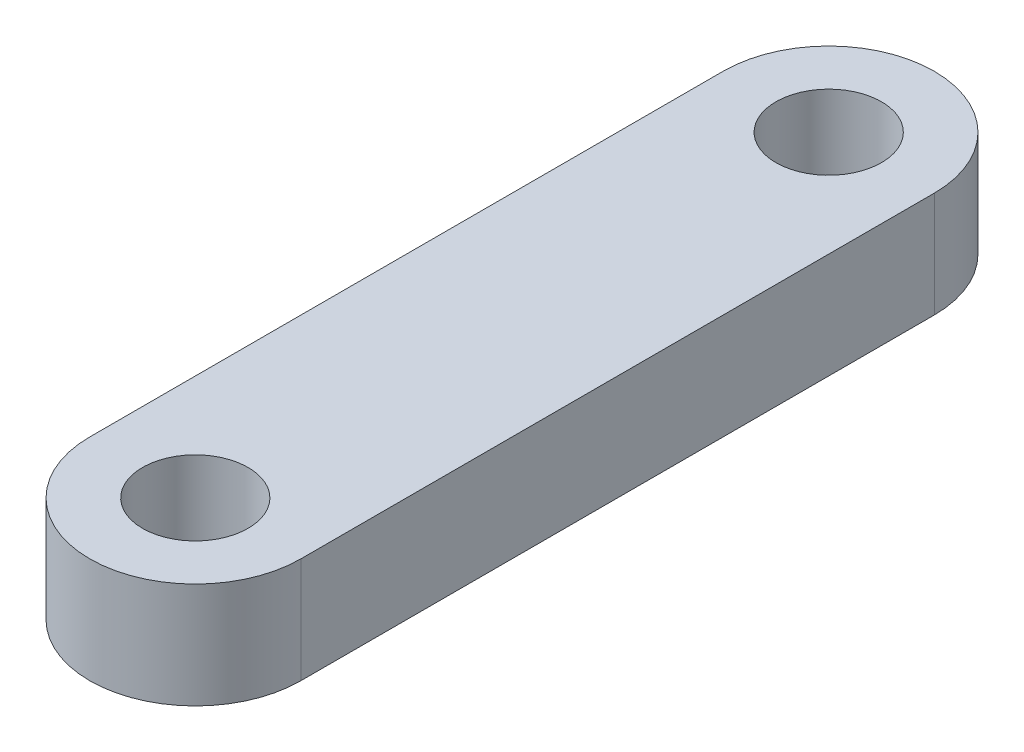
ISO-10303-21;
HEADER;
FILE_DESCRIPTION(('STEP AP214'),'2;1');
FILE_NAME('part.step','',(''),(''),'','','');
FILE_SCHEMA(('AUTOMOTIVE_DESIGN { 1 0 10303 214 1 1 1 1 }'));
ENDSEC;
DATA;
#1=APPLICATION_CONTEXT('core data for automotive mechanical design processes');
#2=APPLICATION_PROTOCOL_DEFINITION('international standard','automotive_design',2000,#1);
#3=PRODUCT_CONTEXT('',#1,'mechanical');
#4=PRODUCT('Part','Part','',(#3));
#5=PRODUCT_RELATED_PRODUCT_CATEGORY('part','',(#4));
#6=PRODUCT_DEFINITION_FORMATION('','',#4);
#7=PRODUCT_DEFINITION_CONTEXT('part definition',#1,'design');
#8=PRODUCT_DEFINITION('design','',#6,#7);
#9=PRODUCT_DEFINITION_SHAPE('','',#8);
#10=(LENGTH_UNIT() NAMED_UNIT(*) SI_UNIT(.MILLI.,.METRE.));
#11=(NAMED_UNIT(*) PLANE_ANGLE_UNIT() SI_UNIT($,.RADIAN.));
#12=(NAMED_UNIT(*) SI_UNIT($,.STERADIAN.) SOLID_ANGLE_UNIT());
#13=UNCERTAINTY_MEASURE_WITH_UNIT(LENGTH_MEASURE(1.E-05),#10,'distance_accuracy_value','');
#14=(GEOMETRIC_REPRESENTATION_CONTEXT(3) GLOBAL_UNCERTAINTY_ASSIGNED_CONTEXT((#13)) GLOBAL_UNIT_ASSIGNED_CONTEXT((#10,
#11,#12)) REPRESENTATION_CONTEXT('',''));
#15=CARTESIAN_POINT('',(0.,0.,0.));
#16=DIRECTION('',(0.,0.,1.));
#17=DIRECTION('',(1.,0.,0.));
#18=AXIS2_PLACEMENT_3D('',#15,#16,#17);
#19=CARTESIAN_POINT('',(12.7,12.7,0.));
#20=DIRECTION('',(0.,-1.,0.));
#21=DIRECTION('',(0.,0.,-1.));
#22=AXIS2_PLACEMENT_3D('',#19,#20,#21);
#23=PLANE('',#22);
#24=CARTESIAN_POINT('',(12.7,12.7,0.));
#25=DIRECTION('',(0.,1.,0.));
#26=DIRECTION('',(0.,0.,-1.));
#27=AXIS2_PLACEMENT_3D('',#24,#25,#26);
#28=CIRCLE('',#27,12.7);
#29=CARTESIAN_POINT('',(25.4,12.7,0.));
#30=VERTEX_POINT('',#29);
#31=CARTESIAN_POINT('',(0.,12.7,0.));
#32=VERTEX_POINT('',#31);
#33=EDGE_CURVE('E87',#30,#32,#28,.T.);
#34=ORIENTED_EDGE('',*,*,#33,.T.);
#35=DIRECTION('',(0.,0.,1.));
#36=VECTOR('',#35,1.);
#37=CARTESIAN_POINT('',(0.,12.7,0.));
#38=LINE('',#37,#36);
#39=CARTESIAN_POINT('',(0.,12.7,76.2));
#40=VERTEX_POINT('',#39);
#41=EDGE_CURVE('E82',#32,#40,#38,.T.);
#42=ORIENTED_EDGE('',*,*,#41,.T.);
#43=CARTESIAN_POINT('',(12.7,12.7,76.2));
#44=DIRECTION('',(0.,1.,0.));
#45=DIRECTION('',(0.,0.,1.));
#46=AXIS2_PLACEMENT_3D('',#43,#44,#45);
#47=CIRCLE('',#46,12.7);
#48=CARTESIAN_POINT('',(25.4,12.7,76.2));
#49=VERTEX_POINT('',#48);
#50=EDGE_CURVE('E85',#40,#49,#47,.T.);
#51=ORIENTED_EDGE('',*,*,#50,.T.);
#52=DIRECTION('',(0.,0.,-1.));
#53=VECTOR('',#52,1.);
#54=CARTESIAN_POINT('',(25.4,12.7,0.));
#55=LINE('',#54,#53);
#56=EDGE_CURVE('E52',#49,#30,#55,.T.);
#57=ORIENTED_EDGE('',*,*,#56,.T.);
#58=EDGE_LOOP('',(#34,#42,#51,#57));
#59=FACE_BOUND('',#58,.T.);
#60=CARTESIAN_POINT('',(12.7,12.7,0.));
#61=DIRECTION('',(0.,1.,0.));
#62=DIRECTION('',(0.,0.,1.));
#63=AXIS2_PLACEMENT_3D('',#60,#61,#62);
#64=CIRCLE('',#63,6.35);
#65=CARTESIAN_POINT('',(12.7,12.7,6.35));
#66=VERTEX_POINT('',#65);
#67=EDGE_CURVE('E102',#66,#66,#64,.T.);
#68=ORIENTED_EDGE('',*,*,#67,.F.);
#69=EDGE_LOOP('',(#68));
#70=FACE_BOUND('',#69,.T.);
#71=CARTESIAN_POINT('',(12.7,12.7,76.2));
#72=DIRECTION('',(0.,1.,0.));
#73=DIRECTION('',(0.,0.,1.));
#74=AXIS2_PLACEMENT_3D('',#71,#72,#73);
#75=CIRCLE('',#74,6.35);
#76=CARTESIAN_POINT('',(12.7,12.7,82.55));
#77=VERTEX_POINT('',#76);
#78=EDGE_CURVE('E117',#77,#77,#75,.T.);
#79=ORIENTED_EDGE('',*,*,#78,.F.);
#80=EDGE_LOOP('',(#79));
#81=FACE_BOUND('',#80,.T.);
#82=ADVANCED_FACE('F35',(#59,#70,#81),#23,.F.);
#83=CARTESIAN_POINT('',(12.7,0.,0.));
#84=DIRECTION('',(0.,-1.,0.));
#85=DIRECTION('',(0.,0.,-1.));
#86=AXIS2_PLACEMENT_3D('',#83,#84,#85);
#87=PLANE('',#86);
#88=CARTESIAN_POINT('',(12.7,0.,0.));
#89=DIRECTION('',(0.,1.,0.));
#90=DIRECTION('',(0.,0.,1.));
#91=AXIS2_PLACEMENT_3D('',#88,#89,#90);
#92=CIRCLE('',#91,6.35);
#93=CARTESIAN_POINT('',(12.7,0.,6.35));
#94=VERTEX_POINT('',#93);
#95=EDGE_CURVE('E114',#94,#94,#92,.T.);
#96=ORIENTED_EDGE('',*,*,#95,.T.);
#97=EDGE_LOOP('',(#96));
#98=FACE_BOUND('',#97,.T.);
#99=CARTESIAN_POINT('',(12.7,0.,0.));
#100=DIRECTION('',(0.,1.,0.));
#101=DIRECTION('',(0.,0.,-1.));
#102=AXIS2_PLACEMENT_3D('',#99,#100,#101);
#103=CIRCLE('',#102,12.7);
#104=CARTESIAN_POINT('',(25.4,0.,0.));
#105=VERTEX_POINT('',#104);
#106=CARTESIAN_POINT('',(0.,0.,0.));
#107=VERTEX_POINT('',#106);
#108=EDGE_CURVE('E99',#105,#107,#103,.T.);
#109=ORIENTED_EDGE('',*,*,#108,.F.);
#110=DIRECTION('',(0.,0.,-1.));
#111=VECTOR('',#110,1.);
#112=CARTESIAN_POINT('',(25.4,0.,0.));
#113=LINE('',#112,#111);
#114=CARTESIAN_POINT('',(25.4,0.,76.2));
#115=VERTEX_POINT('',#114);
#116=EDGE_CURVE('E75',#115,#105,#113,.T.);
#117=ORIENTED_EDGE('',*,*,#116,.F.);
#118=CARTESIAN_POINT('',(12.7,0.,76.2));
#119=DIRECTION('',(0.,1.,0.));
#120=DIRECTION('',(0.,0.,1.));
#121=AXIS2_PLACEMENT_3D('',#118,#119,#120);
#122=CIRCLE('',#121,12.7);
#123=CARTESIAN_POINT('',(0.,0.,76.2));
#124=VERTEX_POINT('',#123);
#125=EDGE_CURVE('E69',#124,#115,#122,.T.);
#126=ORIENTED_EDGE('',*,*,#125,.F.);
#127=DIRECTION('',(0.,0.,1.));
#128=VECTOR('',#127,1.);
#129=CARTESIAN_POINT('',(0.,0.,0.));
#130=LINE('',#129,#128);
#131=EDGE_CURVE('E91',#107,#124,#130,.T.);
#132=ORIENTED_EDGE('',*,*,#131,.F.);
#133=EDGE_LOOP('',(#109,#117,#126,#132));
#134=FACE_BOUND('',#133,.T.);
#135=CARTESIAN_POINT('',(12.7,0.,76.2));
#136=DIRECTION('',(0.,1.,0.));
#137=DIRECTION('',(0.,0.,1.));
#138=AXIS2_PLACEMENT_3D('',#135,#136,#137);
#139=CIRCLE('',#138,6.35);
#140=CARTESIAN_POINT('',(12.7,0.,82.55));
#141=VERTEX_POINT('',#140);
#142=EDGE_CURVE('E120',#141,#141,#139,.T.);
#143=ORIENTED_EDGE('',*,*,#142,.T.);
#144=EDGE_LOOP('',(#143));
#145=FACE_BOUND('',#144,.T.);
#146=ADVANCED_FACE('F110',(#98,#134,#145),#87,.T.);
#147=CARTESIAN_POINT('',(12.7,12.7,0.));
#148=DIRECTION('',(0.,-1.,0.));
#149=DIRECTION('',(0.,0.,-1.));
#150=AXIS2_PLACEMENT_3D('',#147,#148,#149);
#151=CYLINDRICAL_SURFACE('',#150,12.7);
#152=ORIENTED_EDGE('',*,*,#108,.T.);
#153=DIRECTION('',(0.,-1.,0.));
#154=VECTOR('',#153,1.);
#155=CARTESIAN_POINT('',(0.,12.7,0.));
#156=LINE('',#155,#154);
#157=EDGE_CURVE('E11',#32,#107,#156,.T.);
#158=ORIENTED_EDGE('',*,*,#157,.F.);
#159=ORIENTED_EDGE('',*,*,#33,.F.);
#160=DIRECTION('',(0.,-1.,0.));
#161=VECTOR('',#160,1.);
#162=CARTESIAN_POINT('',(25.4,12.7,0.));
#163=LINE('',#162,#161);
#164=EDGE_CURVE('E95',#30,#105,#163,.T.);
#165=ORIENTED_EDGE('',*,*,#164,.T.);
#166=EDGE_LOOP('',(#152,#158,#159,#165));
#167=FACE_BOUND('',#166,.T.);
#168=ADVANCED_FACE('F37',(#167),#151,.T.);
#169=CARTESIAN_POINT('',(0.,12.7,0.));
#170=DIRECTION('',(1.,0.,0.));
#171=DIRECTION('',(0.,0.,-1.));
#172=AXIS2_PLACEMENT_3D('',#169,#170,#171);
#173=PLANE('',#172);
#174=ORIENTED_EDGE('',*,*,#131,.T.);
#175=DIRECTION('',(0.,-1.,0.));
#176=VECTOR('',#175,1.);
#177=CARTESIAN_POINT('',(0.,12.7,76.2));
#178=LINE('',#177,#176);
#179=EDGE_CURVE('E44',#40,#124,#178,.T.);
#180=ORIENTED_EDGE('',*,*,#179,.F.);
#181=ORIENTED_EDGE('',*,*,#41,.F.);
#182=ORIENTED_EDGE('',*,*,#157,.T.);
#183=EDGE_LOOP('',(#174,#180,#181,#182));
#184=FACE_BOUND('',#183,.T.);
#185=ADVANCED_FACE('F90',(#184),#173,.F.);
#186=CARTESIAN_POINT('',(12.7,12.7,76.2));
#187=DIRECTION('',(0.,-1.,0.));
#188=DIRECTION('',(0.,0.,-1.));
#189=AXIS2_PLACEMENT_3D('',#186,#187,#188);
#190=CYLINDRICAL_SURFACE('',#189,12.7);
#191=ORIENTED_EDGE('',*,*,#125,.T.);
#192=DIRECTION('',(0.,-1.,0.));
#193=VECTOR('',#192,1.);
#194=CARTESIAN_POINT('',(25.4,12.7,76.2));
#195=LINE('',#194,#193);
#196=EDGE_CURVE('E92',#49,#115,#195,.T.);
#197=ORIENTED_EDGE('',*,*,#196,.F.);
#198=ORIENTED_EDGE('',*,*,#50,.F.);
#199=ORIENTED_EDGE('',*,*,#179,.T.);
#200=EDGE_LOOP('',(#191,#197,#198,#199));
#201=FACE_BOUND('',#200,.T.);
#202=ADVANCED_FACE('F93',(#201),#190,.T.);
#203=CARTESIAN_POINT('',(25.4,12.7,0.));
#204=DIRECTION('',(-1.,0.,0.));
#205=DIRECTION('',(0.,0.,1.));
#206=AXIS2_PLACEMENT_3D('',#203,#204,#205);
#207=PLANE('',#206);
#208=ORIENTED_EDGE('',*,*,#116,.T.);
#209=ORIENTED_EDGE('',*,*,#164,.F.);
#210=ORIENTED_EDGE('',*,*,#56,.F.);
#211=ORIENTED_EDGE('',*,*,#196,.T.);
#212=EDGE_LOOP('',(#208,#209,#210,#211));
#213=FACE_BOUND('',#212,.T.);
#214=ADVANCED_FACE('F107',(#213),#207,.F.);
#215=CARTESIAN_POINT('',(12.7,12.7,0.));
#216=DIRECTION('',(0.,-1.,0.));
#217=DIRECTION('',(0.,0.,-1.));
#218=AXIS2_PLACEMENT_3D('',#215,#216,#217);
#219=CYLINDRICAL_SURFACE('',#218,6.35);
#220=ORIENTED_EDGE('',*,*,#67,.T.);
#221=EDGE_LOOP('',(#220));
#222=FACE_BOUND('',#221,.T.);
#223=ORIENTED_EDGE('',*,*,#95,.F.);
#224=EDGE_LOOP('',(#223));
#225=FACE_BOUND('',#224,.T.);
#226=ADVANCED_FACE('F137',(#222,#225),#219,.F.);
#227=CARTESIAN_POINT('',(12.7,12.7,76.2));
#228=DIRECTION('',(0.,-1.,0.));
#229=DIRECTION('',(0.,0.,-1.));
#230=AXIS2_PLACEMENT_3D('',#227,#228,#229);
#231=CYLINDRICAL_SURFACE('',#230,6.35);
#232=ORIENTED_EDGE('',*,*,#78,.T.);
#233=EDGE_LOOP('',(#232));
#234=FACE_BOUND('',#233,.T.);
#235=ORIENTED_EDGE('',*,*,#142,.F.);
#236=EDGE_LOOP('',(#235));
#237=FACE_BOUND('',#236,.T.);
#238=ADVANCED_FACE('F126',(#234,#237),#231,.F.);
#239=CLOSED_SHELL('',(#82,#146,#168,#185,#202,#214,#226,#238));
#240=MANIFOLD_SOLID_BREP('B2',#239);
#241=ADVANCED_BREP_SHAPE_REPRESENTATION('',(#18,#240),#14);
#242=SHAPE_DEFINITION_REPRESENTATION(#9,#241);
ENDSEC;
END-ISO-10303-21;
